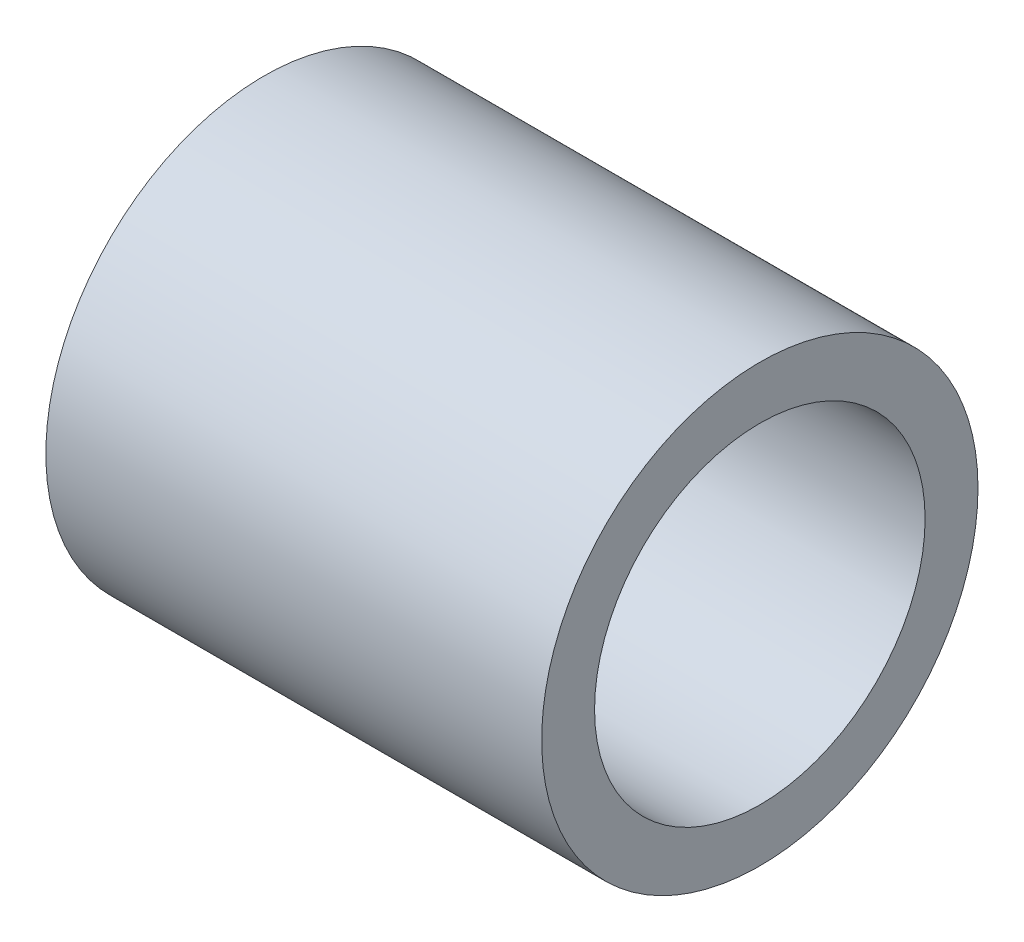
ISO-10303-21;
HEADER;
FILE_DESCRIPTION(('STEP AP214'),'2;1');
FILE_NAME('part.step','',(''),(''),'','','');
FILE_SCHEMA(('AUTOMOTIVE_DESIGN { 1 0 10303 214 1 1 1 1 }'));
ENDSEC;
DATA;
#1=APPLICATION_CONTEXT('core data for automotive mechanical design processes');
#2=APPLICATION_PROTOCOL_DEFINITION('international standard','automotive_design',2000,#1);
#3=PRODUCT_CONTEXT('',#1,'mechanical');
#4=PRODUCT('Part','Part','',(#3));
#5=PRODUCT_RELATED_PRODUCT_CATEGORY('part','',(#4));
#6=PRODUCT_DEFINITION_FORMATION('','',#4);
#7=PRODUCT_DEFINITION_CONTEXT('part definition',#1,'design');
#8=PRODUCT_DEFINITION('design','',#6,#7);
#9=PRODUCT_DEFINITION_SHAPE('','',#8);
#10=(LENGTH_UNIT() NAMED_UNIT(*) SI_UNIT(.MILLI.,.METRE.));
#11=(NAMED_UNIT(*) PLANE_ANGLE_UNIT() SI_UNIT($,.RADIAN.));
#12=(NAMED_UNIT(*) SI_UNIT($,.STERADIAN.) SOLID_ANGLE_UNIT());
#13=UNCERTAINTY_MEASURE_WITH_UNIT(LENGTH_MEASURE(1.E-05),#10,'distance_accuracy_value','');
#14=(GEOMETRIC_REPRESENTATION_CONTEXT(3) GLOBAL_UNCERTAINTY_ASSIGNED_CONTEXT((#13)) GLOBAL_UNIT_ASSIGNED_CONTEXT((#10,
#11,#12)) REPRESENTATION_CONTEXT('',''));
#15=CARTESIAN_POINT('',(0.,0.,0.));
#16=DIRECTION('',(0.,0.,1.));
#17=DIRECTION('',(1.,0.,0.));
#18=AXIS2_PLACEMENT_3D('',#15,#16,#17);
#19=CARTESIAN_POINT('',(9.525,0.,0.));
#20=DIRECTION('',(1.,0.,0.));
#21=DIRECTION('',(0.,0.,-1.));
#22=AXIS2_PLACEMENT_3D('',#19,#20,#21);
#23=PLANE('',#22);
#24=CARTESIAN_POINT('',(9.525,0.,0.));
#25=DIRECTION('',(1.,0.,0.));
#26=DIRECTION('',(0.,0.,-1.));
#27=AXIS2_PLACEMENT_3D('',#24,#25,#26);
#28=CIRCLE('',#27,4.191);
#29=CARTESIAN_POINT('',(9.525,0.,-4.191));
#30=VERTEX_POINT('',#29);
#31=EDGE_CURVE('E10',#30,#30,#28,.T.);
#32=ORIENTED_EDGE('',*,*,#31,.T.);
#33=EDGE_LOOP('',(#32));
#34=FACE_BOUND('',#33,.T.);
#35=CARTESIAN_POINT('',(9.525,0.,0.));
#36=DIRECTION('',(1.,0.,0.));
#37=DIRECTION('',(0.,0.,-1.));
#38=AXIS2_PLACEMENT_3D('',#35,#36,#37);
#39=CIRCLE('',#38,3.175);
#40=CARTESIAN_POINT('',(9.525,0.,-3.175));
#41=VERTEX_POINT('',#40);
#42=EDGE_CURVE('E50',#41,#41,#39,.T.);
#43=ORIENTED_EDGE('',*,*,#42,.F.);
#44=EDGE_LOOP('',(#43));
#45=FACE_BOUND('',#44,.T.);
#46=ADVANCED_FACE('F37',(#34,#45),#23,.T.);
#47=CARTESIAN_POINT('',(0.,0.,0.));
#48=DIRECTION('',(1.,0.,0.));
#49=DIRECTION('',(0.,0.,-1.));
#50=AXIS2_PLACEMENT_3D('',#47,#48,#49);
#51=PLANE('',#50);
#52=CARTESIAN_POINT('',(0.,0.,0.));
#53=DIRECTION('',(1.,0.,0.));
#54=DIRECTION('',(0.,0.,-1.));
#55=AXIS2_PLACEMENT_3D('',#52,#53,#54);
#56=CIRCLE('',#55,4.191);
#57=CARTESIAN_POINT('',(0.,0.,-4.191));
#58=VERTEX_POINT('',#57);
#59=EDGE_CURVE('E41',#58,#58,#56,.T.);
#60=ORIENTED_EDGE('',*,*,#59,.F.);
#61=EDGE_LOOP('',(#60));
#62=FACE_BOUND('',#61,.T.);
#63=CARTESIAN_POINT('',(0.,0.,0.));
#64=DIRECTION('',(1.,0.,0.));
#65=DIRECTION('',(0.,0.,-1.));
#66=AXIS2_PLACEMENT_3D('',#63,#64,#65);
#67=CIRCLE('',#66,3.175);
#68=CARTESIAN_POINT('',(0.,0.,-3.175));
#69=VERTEX_POINT('',#68);
#70=EDGE_CURVE('E52',#69,#69,#67,.T.);
#71=ORIENTED_EDGE('',*,*,#70,.T.);
#72=EDGE_LOOP('',(#71));
#73=FACE_BOUND('',#72,.T.);
#74=ADVANCED_FACE('F64',(#62,#73),#51,.F.);
#75=CARTESIAN_POINT('',(9.525,0.,0.));
#76=DIRECTION('',(-1.,0.,0.));
#77=DIRECTION('',(0.,0.,1.));
#78=AXIS2_PLACEMENT_3D('',#75,#76,#77);
#79=CYLINDRICAL_SURFACE('',#78,4.191);
#80=ORIENTED_EDGE('',*,*,#31,.F.);
#81=EDGE_LOOP('',(#80));
#82=FACE_BOUND('',#81,.T.);
#83=ORIENTED_EDGE('',*,*,#59,.T.);
#84=EDGE_LOOP('',(#83));
#85=FACE_BOUND('',#84,.T.);
#86=ADVANCED_FACE('F39',(#82,#85),#79,.T.);
#87=CARTESIAN_POINT('',(9.525,0.,0.));
#88=DIRECTION('',(-1.,0.,0.));
#89=DIRECTION('',(0.,0.,1.));
#90=AXIS2_PLACEMENT_3D('',#87,#88,#89);
#91=CYLINDRICAL_SURFACE('',#90,3.175);
#92=ORIENTED_EDGE('',*,*,#42,.T.);
#93=EDGE_LOOP('',(#92));
#94=FACE_BOUND('',#93,.T.);
#95=ORIENTED_EDGE('',*,*,#70,.F.);
#96=EDGE_LOOP('',(#95));
#97=FACE_BOUND('',#96,.T.);
#98=ADVANCED_FACE('F60',(#94,#97),#91,.F.);
#99=CLOSED_SHELL('',(#46,#74,#86,#98));
#100=MANIFOLD_SOLID_BREP('B2',#99);
#101=ADVANCED_BREP_SHAPE_REPRESENTATION('',(#18,#100),#14);
#102=SHAPE_DEFINITION_REPRESENTATION(#9,#101);
ENDSEC;
END-ISO-10303-21;
